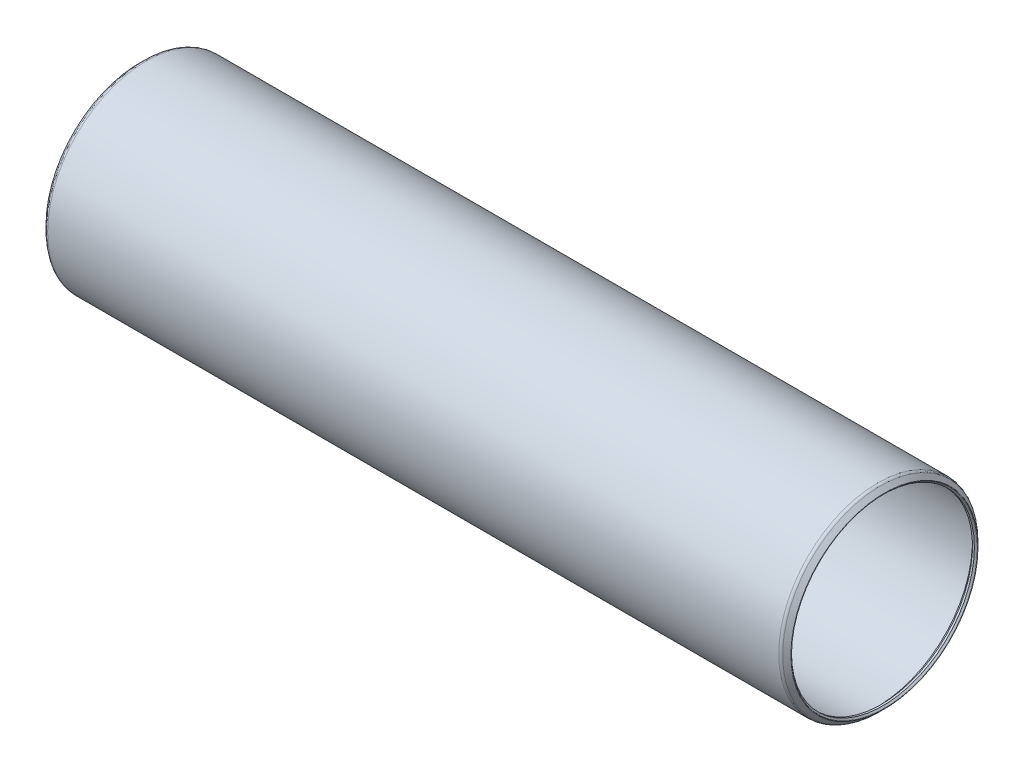
ISO-10303-21;
HEADER;
FILE_DESCRIPTION(('STEP AP214'),'2;1');
FILE_NAME('part.step','',(''),(''),'','','');
FILE_SCHEMA(('AUTOMOTIVE_DESIGN { 1 0 10303 214 1 1 1 1 }'));
ENDSEC;
DATA;
#1=APPLICATION_CONTEXT('core data for automotive mechanical design processes');
#2=APPLICATION_PROTOCOL_DEFINITION('international standard','automotive_design',2000,#1);
#3=PRODUCT_CONTEXT('',#1,'mechanical');
#4=PRODUCT('Part','Part','',(#3));
#5=PRODUCT_RELATED_PRODUCT_CATEGORY('part','',(#4));
#6=PRODUCT_DEFINITION_FORMATION('','',#4);
#7=PRODUCT_DEFINITION_CONTEXT('part definition',#1,'design');
#8=PRODUCT_DEFINITION('design','',#6,#7);
#9=PRODUCT_DEFINITION_SHAPE('','',#8);
#10=(LENGTH_UNIT() NAMED_UNIT(*) SI_UNIT(.MILLI.,.METRE.));
#11=(NAMED_UNIT(*) PLANE_ANGLE_UNIT() SI_UNIT($,.RADIAN.));
#12=(NAMED_UNIT(*) SI_UNIT($,.STERADIAN.) SOLID_ANGLE_UNIT());
#13=UNCERTAINTY_MEASURE_WITH_UNIT(LENGTH_MEASURE(1.E-05),#10,'distance_accuracy_value','');
#14=(GEOMETRIC_REPRESENTATION_CONTEXT(3) GLOBAL_UNCERTAINTY_ASSIGNED_CONTEXT((#13)) GLOBAL_UNIT_ASSIGNED_CONTEXT((#10,
#11,#12)) REPRESENTATION_CONTEXT('',''));
#15=CARTESIAN_POINT('',(0.,0.,0.));
#16=DIRECTION('',(0.,0.,1.));
#17=DIRECTION('',(1.,0.,0.));
#18=AXIS2_PLACEMENT_3D('',#15,#16,#17);
#19=CARTESIAN_POINT('',(197.7898,0.,0.));
#20=DIRECTION('',(-1.,0.,0.));
#21=DIRECTION('',(0.,0.,1.));
#22=AXIS2_PLACEMENT_3D('',#19,#20,#21);
#23=CYLINDRICAL_SURFACE('',#22,25.57145);
#24=CARTESIAN_POINT('',(1.0541,0.,0.));
#25=DIRECTION('',(1.,0.,0.));
#26=DIRECTION('',(0.,0.,-1.));
#27=AXIS2_PLACEMENT_3D('',#24,#25,#26);
#28=CIRCLE('',#27,25.57145);
#29=CARTESIAN_POINT('',(1.0541,0.,-25.57145));
#30=VERTEX_POINT('',#29);
#31=EDGE_CURVE('E116',#30,#30,#28,.F.);
#32=ORIENTED_EDGE('',*,*,#31,.T.);
#33=EDGE_LOOP('',(#32));
#34=FACE_BOUND('',#33,.T.);
#35=CARTESIAN_POINT('',(196.7357,0.,0.));
#36=DIRECTION('',(-1.,0.,0.));
#37=DIRECTION('',(0.,0.,1.));
#38=AXIS2_PLACEMENT_3D('',#35,#36,#37);
#39=CIRCLE('',#38,25.57145);
#40=CARTESIAN_POINT('',(196.7357,0.,25.57145));
#41=VERTEX_POINT('',#40);
#42=EDGE_CURVE('E111',#41,#41,#39,.F.);
#43=ORIENTED_EDGE('',*,*,#42,.T.);
#44=EDGE_LOOP('',(#43));
#45=FACE_BOUND('',#44,.T.);
#46=ADVANCED_FACE('F14',(#34,#45),#23,.F.);
#47=CARTESIAN_POINT('',(1.0541,0.,0.));
#48=DIRECTION('',(1.,0.,0.));
#49=DIRECTION('',(0.,0.,-1.));
#50=AXIS2_PLACEMENT_3D('',#47,#48,#49);
#51=CONICAL_SURFACE('',#50,25.57145,0.785398163397447);
#52=CARTESIAN_POINT('',(0.,0.,0.));
#53=DIRECTION('',(-1.,0.,0.));
#54=DIRECTION('',(0.,0.,1.));
#55=AXIS2_PLACEMENT_3D('',#52,#53,#54);
#56=CIRCLE('',#55,24.51735);
#57=CARTESIAN_POINT('',(0.,0.,24.51735));
#58=VERTEX_POINT('',#57);
#59=EDGE_CURVE('E106',#58,#58,#56,.T.);
#60=ORIENTED_EDGE('',*,*,#59,.T.);
#61=EDGE_LOOP('',(#60));
#62=FACE_BOUND('',#61,.T.);
#63=ORIENTED_EDGE('',*,*,#31,.F.);
#64=EDGE_LOOP('',(#63));
#65=FACE_BOUND('',#64,.T.);
#66=ADVANCED_FACE('F123',(#62,#65),#51,.F.);
#67=CARTESIAN_POINT('',(196.7357,0.,0.));
#68=DIRECTION('',(-1.,0.,0.));
#69=DIRECTION('',(0.,-1.,0.));
#70=AXIS2_PLACEMENT_3D('',#67,#68,#69);
#71=CONICAL_SURFACE('',#70,25.57145,0.785398163397434);
#72=ORIENTED_EDGE('',*,*,#42,.F.);
#73=EDGE_LOOP('',(#72));
#74=FACE_BOUND('',#73,.T.);
#75=CARTESIAN_POINT('',(197.7898,0.,0.));
#76=DIRECTION('',(-1.,0.,0.));
#77=DIRECTION('',(0.,0.,1.));
#78=AXIS2_PLACEMENT_3D('',#75,#76,#77);
#79=CIRCLE('',#78,24.51735);
#80=CARTESIAN_POINT('',(197.7898,0.,24.51735));
#81=VERTEX_POINT('',#80);
#82=EDGE_CURVE('E101',#81,#81,#79,.F.);
#83=ORIENTED_EDGE('',*,*,#82,.T.);
#84=EDGE_LOOP('',(#83));
#85=FACE_BOUND('',#84,.T.);
#86=ADVANCED_FACE('F125',(#74,#85),#71,.F.);
#87=CARTESIAN_POINT('',(197.7898,0.,0.));
#88=DIRECTION('',(-1.,0.,0.));
#89=DIRECTION('',(0.,0.,1.));
#90=AXIS2_PLACEMENT_3D('',#87,#88,#89);
#91=CYLINDRICAL_SURFACE('',#90,24.51735);
#92=CARTESIAN_POINT('',(-0.527050000000001,0.,0.));
#93=DIRECTION('',(-1.,0.,0.));
#94=DIRECTION('',(0.,0.,1.));
#95=AXIS2_PLACEMENT_3D('',#92,#93,#94);
#96=CIRCLE('',#95,24.51735);
#97=CARTESIAN_POINT('',(-0.527050000000001,0.,24.51735));
#98=VERTEX_POINT('',#97);
#99=EDGE_CURVE('E96',#98,#98,#96,.T.);
#100=ORIENTED_EDGE('',*,*,#99,.T.);
#101=EDGE_LOOP('',(#100));
#102=FACE_BOUND('',#101,.T.);
#103=ORIENTED_EDGE('',*,*,#59,.F.);
#104=EDGE_LOOP('',(#103));
#105=FACE_BOUND('',#104,.T.);
#106=ADVANCED_FACE('F132',(#102,#105),#91,.F.);
#107=CARTESIAN_POINT('',(197.7898,0.,0.));
#108=DIRECTION('',(-1.,0.,0.));
#109=DIRECTION('',(0.,0.,1.));
#110=AXIS2_PLACEMENT_3D('',#107,#108,#109);
#111=CYLINDRICAL_SURFACE('',#110,24.51735);
#112=ORIENTED_EDGE('',*,*,#82,.F.);
#113=EDGE_LOOP('',(#112));
#114=FACE_BOUND('',#113,.T.);
#115=CARTESIAN_POINT('',(198.31685,0.,0.));
#116=DIRECTION('',(1.,0.,0.));
#117=DIRECTION('',(0.,0.,-1.));
#118=AXIS2_PLACEMENT_3D('',#115,#116,#117);
#119=CIRCLE('',#118,24.51735);
#120=CARTESIAN_POINT('',(198.31685,0.,-24.51735));
#121=VERTEX_POINT('',#120);
#122=EDGE_CURVE('E91',#121,#121,#119,.T.);
#123=ORIENTED_EDGE('',*,*,#122,.T.);
#124=EDGE_LOOP('',(#123));
#125=FACE_BOUND('',#124,.T.);
#126=ADVANCED_FACE('F152',(#114,#125),#111,.F.);
#127=CARTESIAN_POINT('',(-0.919083696838046,0.,0.));
#128=DIRECTION('',(-1.,0.,0.));
#129=DIRECTION('',(0.,-1.,0.));
#130=AXIS2_PLACEMENT_3D('',#127,#128,#129);
#131=CONICAL_SURFACE('',#130,24.909383696838,0.785398163397453);
#132=CARTESIAN_POINT('',(-0.919083696838046,0.,0.));
#133=DIRECTION('',(1.,0.,0.));
#134=DIRECTION('',(0.,0.,-1.));
#135=AXIS2_PLACEMENT_3D('',#132,#133,#134);
#136=CIRCLE('',#135,24.909383696838);
#137=CARTESIAN_POINT('',(-0.919083696838046,0.,-24.909383696838));
#138=VERTEX_POINT('',#137);
#139=EDGE_CURVE('E88',#138,#138,#136,.T.);
#140=ORIENTED_EDGE('',*,*,#139,.F.);
#141=EDGE_LOOP('',(#140));
#142=FACE_BOUND('',#141,.T.);
#143=ORIENTED_EDGE('',*,*,#99,.F.);
#144=EDGE_LOOP('',(#143));
#145=FACE_BOUND('',#144,.T.);
#146=ADVANCED_FACE('F149',(#142,#145),#131,.F.);
#147=CARTESIAN_POINT('',(198.708883696838,0.,0.));
#148=DIRECTION('',(1.,0.,0.));
#149=DIRECTION('',(0.,1.,0.));
#150=AXIS2_PLACEMENT_3D('',#147,#148,#149);
#151=CONICAL_SURFACE('',#150,24.9093836968381,0.785398163397448);
#152=ORIENTED_EDGE('',*,*,#122,.F.);
#153=EDGE_LOOP('',(#152));
#154=FACE_BOUND('',#153,.T.);
#155=CARTESIAN_POINT('',(198.708883696838,0.,0.));
#156=DIRECTION('',(1.,0.,0.));
#157=DIRECTION('',(0.,0.,-1.));
#158=AXIS2_PLACEMENT_3D('',#155,#156,#157);
#159=CIRCLE('',#158,24.9093836968381);
#160=CARTESIAN_POINT('',(198.708883696838,0.,-24.9093836968381));
#161=VERTEX_POINT('',#160);
#162=EDGE_CURVE('E66',#161,#161,#159,.F.);
#163=ORIENTED_EDGE('',*,*,#162,.F.);
#164=EDGE_LOOP('',(#163));
#165=FACE_BOUND('',#164,.T.);
#166=ADVANCED_FACE('F82',(#154,#165),#151,.F.);
#167=CARTESIAN_POINT('',(-0.829281135627363,0.,0.));
#168=DIRECTION('',(1.,0.,0.));
#169=DIRECTION('',(0.,0.,-1.));
#170=AXIS2_PLACEMENT_3D('',#167,#168,#169);
#171=TOROIDAL_SURFACE('',#170,24.9991862580487,0.126999999999997);
#172=CARTESIAN_POINT('',(-0.919083696838019,0.,0.));
#173=DIRECTION('',(1.,0.,0.));
#174=DIRECTION('',(0.,0.,-1.));
#175=AXIS2_PLACEMENT_3D('',#172,#173,#174);
#176=CIRCLE('',#175,25.0889888192594);
#177=CARTESIAN_POINT('',(-0.919083696838018,0.,-25.0889888192594));
#178=VERTEX_POINT('',#177);
#179=EDGE_CURVE('E61',#178,#178,#176,.T.);
#180=ORIENTED_EDGE('',*,*,#179,.F.);
#181=EDGE_LOOP('',(#180));
#182=FACE_BOUND('',#181,.T.);
#183=ORIENTED_EDGE('',*,*,#139,.T.);
#184=EDGE_LOOP('',(#183));
#185=FACE_BOUND('',#184,.T.);
#186=ADVANCED_FACE('F77',(#182,#185),#171,.T.);
#187=CARTESIAN_POINT('',(198.619081135627,0.,0.));
#188=DIRECTION('',(1.,0.,0.));
#189=DIRECTION('',(0.,0.,-1.));
#190=AXIS2_PLACEMENT_3D('',#187,#188,#189);
#191=TOROIDAL_SURFACE('',#190,24.9991862580487,0.127000000000013);
#192=ORIENTED_EDGE('',*,*,#162,.T.);
#193=EDGE_LOOP('',(#192));
#194=FACE_BOUND('',#193,.T.);
#195=CARTESIAN_POINT('',(198.708883696838,0.,0.));
#196=DIRECTION('',(-1.,0.,0.));
#197=DIRECTION('',(0.,0.,1.));
#198=AXIS2_PLACEMENT_3D('',#195,#196,#197);
#199=CIRCLE('',#198,25.0889888192594);
#200=CARTESIAN_POINT('',(198.708883696838,0.,25.0889888192594));
#201=VERTEX_POINT('',#200);
#202=EDGE_CURVE('E56',#201,#201,#199,.T.);
#203=ORIENTED_EDGE('',*,*,#202,.F.);
#204=EDGE_LOOP('',(#203));
#205=FACE_BOUND('',#204,.T.);
#206=ADVANCED_FACE('F73',(#194,#205),#191,.T.);
#207=CARTESIAN_POINT('',(0.16903874195126,0.,0.));
#208=DIRECTION('',(1.,0.,0.));
#209=DIRECTION('',(0.,1.,0.));
#210=AXIS2_PLACEMENT_3D('',#207,#208,#209);
#211=CONICAL_SURFACE('',#210,26.1771112580487,0.785398163397447);
#212=CARTESIAN_POINT('',(0.169038741951243,0.,0.));
#213=DIRECTION('',(1.,0.,0.));
#214=DIRECTION('',(0.,0.,-1.));
#215=AXIS2_PLACEMENT_3D('',#212,#213,#214);
#216=CIRCLE('',#215,26.1771112580487);
#217=CARTESIAN_POINT('',(0.169038741951243,0.,-26.1771112580487));
#218=VERTEX_POINT('',#217);
#219=EDGE_CURVE('E53',#218,#218,#216,.T.);
#220=ORIENTED_EDGE('',*,*,#219,.F.);
#221=EDGE_LOOP('',(#220));
#222=FACE_BOUND('',#221,.T.);
#223=ORIENTED_EDGE('',*,*,#179,.T.);
#224=EDGE_LOOP('',(#223));
#225=FACE_BOUND('',#224,.T.);
#226=ADVANCED_FACE('F76',(#222,#225),#211,.T.);
#227=CARTESIAN_POINT('',(197.620761258049,0.,0.));
#228=DIRECTION('',(-1.,0.,0.));
#229=DIRECTION('',(0.,-1.,0.));
#230=AXIS2_PLACEMENT_3D('',#227,#228,#229);
#231=CONICAL_SURFACE('',#230,26.1771112580487,0.785398163397447);
#232=ORIENTED_EDGE('',*,*,#202,.T.);
#233=EDGE_LOOP('',(#232));
#234=FACE_BOUND('',#233,.T.);
#235=CARTESIAN_POINT('',(197.620761258049,0.,0.));
#236=DIRECTION('',(1.,0.,0.));
#237=DIRECTION('',(0.,0.,-1.));
#238=AXIS2_PLACEMENT_3D('',#235,#236,#237);
#239=CIRCLE('',#238,26.1771112580487);
#240=CARTESIAN_POINT('',(197.620761258049,0.,-26.1771112580487));
#241=VERTEX_POINT('',#240);
#242=EDGE_CURVE('E26',#241,#241,#239,.F.);
#243=ORIENTED_EDGE('',*,*,#242,.F.);
#244=EDGE_LOOP('',(#243));
#245=FACE_BOUND('',#244,.T.);
#246=ADVANCED_FACE('F47',(#234,#245),#231,.T.);
#247=CARTESIAN_POINT('',(0.9144,0.,0.));
#248=DIRECTION('',(1.,0.,0.));
#249=DIRECTION('',(0.,0.,-1.));
#250=AXIS2_PLACEMENT_3D('',#247,#248,#249);
#251=TOROIDAL_SURFACE('',#250,25.43175,1.05409999999999);
#252=CARTESIAN_POINT('',(0.914399999999982,0.,0.));
#253=DIRECTION('',(-1.,0.,0.));
#254=DIRECTION('',(0.,0.,1.));
#255=AXIS2_PLACEMENT_3D('',#252,#253,#254);
#256=CIRCLE('',#255,26.48585);
#257=CARTESIAN_POINT('',(0.914399999999982,0.,26.48585));
#258=VERTEX_POINT('',#257);
#259=EDGE_CURVE('E21',#258,#258,#256,.F.);
#260=ORIENTED_EDGE('',*,*,#259,.F.);
#261=EDGE_LOOP('',(#260));
#262=FACE_BOUND('',#261,.T.);
#263=ORIENTED_EDGE('',*,*,#219,.T.);
#264=EDGE_LOOP('',(#263));
#265=FACE_BOUND('',#264,.T.);
#266=ADVANCED_FACE('F42',(#262,#265),#251,.T.);
#267=CARTESIAN_POINT('',(196.8754,0.,0.));
#268=DIRECTION('',(1.,0.,0.));
#269=DIRECTION('',(0.,0.,-1.));
#270=AXIS2_PLACEMENT_3D('',#267,#268,#269);
#271=TOROIDAL_SURFACE('',#270,25.43175,1.05409999999996);
#272=ORIENTED_EDGE('',*,*,#242,.T.);
#273=EDGE_LOOP('',(#272));
#274=FACE_BOUND('',#273,.T.);
#275=CARTESIAN_POINT('',(196.8754,0.,0.));
#276=DIRECTION('',(-1.,0.,0.));
#277=DIRECTION('',(0.,0.,1.));
#278=AXIS2_PLACEMENT_3D('',#275,#276,#277);
#279=CIRCLE('',#278,26.48585);
#280=CARTESIAN_POINT('',(196.8754,0.,26.48585));
#281=VERTEX_POINT('',#280);
#282=EDGE_CURVE('E10',#281,#281,#279,.T.);
#283=ORIENTED_EDGE('',*,*,#282,.F.);
#284=EDGE_LOOP('',(#283));
#285=FACE_BOUND('',#284,.T.);
#286=ADVANCED_FACE('F37',(#274,#285),#271,.T.);
#287=CARTESIAN_POINT('',(197.7898,0.,0.));
#288=DIRECTION('',(-1.,0.,0.));
#289=DIRECTION('',(0.,0.,1.));
#290=AXIS2_PLACEMENT_3D('',#287,#288,#289);
#291=CYLINDRICAL_SURFACE('',#290,26.48585);
#292=ORIENTED_EDGE('',*,*,#282,.T.);
#293=EDGE_LOOP('',(#292));
#294=FACE_BOUND('',#293,.T.);
#295=ORIENTED_EDGE('',*,*,#259,.T.);
#296=EDGE_LOOP('',(#295));
#297=FACE_BOUND('',#296,.T.);
#298=ADVANCED_FACE('F41',(#294,#297),#291,.T.);
#299=CLOSED_SHELL('',(#46,#66,#86,#106,#126,#146,#166,#186,#206,#226,#246,#266,#286,#298));
#300=MANIFOLD_SOLID_BREP('B1',#299);
#301=ADVANCED_BREP_SHAPE_REPRESENTATION('',(#18,#300),#14);
#302=SHAPE_DEFINITION_REPRESENTATION(#9,#301);
ENDSEC;
END-ISO-10303-21;
